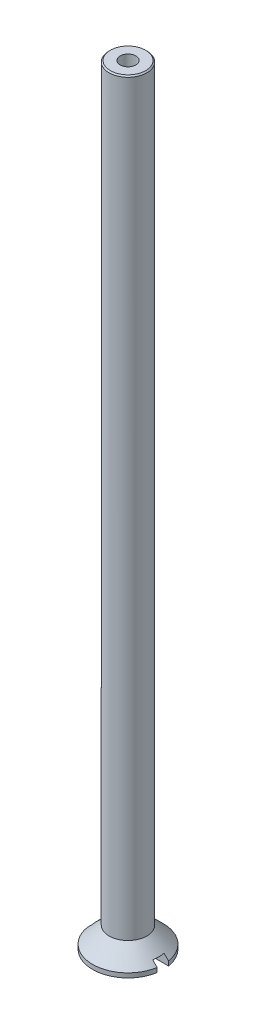
ISO-10303-21;
HEADER;
FILE_DESCRIPTION(('STEP AP214'),'2;1');
FILE_NAME('part.step','',(''),(''),'','','');
FILE_SCHEMA(('AUTOMOTIVE_DESIGN { 1 0 10303 214 1 1 1 1 }'));
ENDSEC;
DATA;
#1=APPLICATION_CONTEXT('core data for automotive mechanical design processes');
#2=APPLICATION_PROTOCOL_DEFINITION('international standard','automotive_design',2000,#1);
#3=PRODUCT_CONTEXT('',#1,'mechanical');
#4=PRODUCT('Part','Part','',(#3));
#5=PRODUCT_RELATED_PRODUCT_CATEGORY('part','',(#4));
#6=PRODUCT_DEFINITION_FORMATION('','',#4);
#7=PRODUCT_DEFINITION_CONTEXT('part definition',#1,'design');
#8=PRODUCT_DEFINITION('design','',#6,#7);
#9=PRODUCT_DEFINITION_SHAPE('','',#8);
#10=(LENGTH_UNIT() NAMED_UNIT(*) SI_UNIT(.MILLI.,.METRE.));
#11=(NAMED_UNIT(*) PLANE_ANGLE_UNIT() SI_UNIT($,.RADIAN.));
#12=(NAMED_UNIT(*) SI_UNIT($,.STERADIAN.) SOLID_ANGLE_UNIT());
#13=UNCERTAINTY_MEASURE_WITH_UNIT(LENGTH_MEASURE(1.E-05),#10,'distance_accuracy_value','');
#14=(GEOMETRIC_REPRESENTATION_CONTEXT(3) GLOBAL_UNCERTAINTY_ASSIGNED_CONTEXT((#13)) GLOBAL_UNIT_ASSIGNED_CONTEXT((#10,
#11,#12)) REPRESENTATION_CONTEXT('',''));
#15=CARTESIAN_POINT('',(0.,0.,0.));
#16=DIRECTION('',(0.,0.,1.));
#17=DIRECTION('',(1.,0.,0.));
#18=AXIS2_PLACEMENT_3D('',#15,#16,#17);
#19=CARTESIAN_POINT('',(0.,0.,0.));
#20=DIRECTION('',(0.,-1.,0.));
#21=DIRECTION('',(0.,0.,-1.));
#22=AXIS2_PLACEMENT_3D('',#19,#20,#21);
#23=CYLINDRICAL_SURFACE('',#22,2.8);
#24=CARTESIAN_POINT('',(0.,0.35,0.));
#25=DIRECTION('',(0.,-1.,0.));
#26=DIRECTION('',(0.,0.,-1.));
#27=AXIS2_PLACEMENT_3D('',#24,#25,#26);
#28=CIRCLE('',#27,2.8);
#29=CARTESIAN_POINT('',(-2.7636027210871,0.35,-0.45));
#30=VERTEX_POINT('',#29);
#31=CARTESIAN_POINT('',(2.7636027210871,0.35,-0.45));
#32=VERTEX_POINT('',#31);
#33=EDGE_CURVE('E182',#30,#32,#28,.T.);
#34=ORIENTED_EDGE('',*,*,#33,.T.);
#35=DIRECTION('',(0.,-1.,0.));
#36=VECTOR('',#35,1.);
#37=CARTESIAN_POINT('',(2.7636027210871,0.,-0.45));
#38=LINE('',#37,#36);
#39=CARTESIAN_POINT('',(2.7636027210871,0.,-0.45));
#40=VERTEX_POINT('',#39);
#41=EDGE_CURVE('E142',#32,#40,#38,.T.);
#42=ORIENTED_EDGE('',*,*,#41,.T.);
#43=CARTESIAN_POINT('',(0.,0.,0.));
#44=DIRECTION('',(0.,-1.,0.));
#45=DIRECTION('',(0.,0.,-1.));
#46=AXIS2_PLACEMENT_3D('',#43,#44,#45);
#47=CIRCLE('',#46,2.8);
#48=CARTESIAN_POINT('',(-2.7636027210871,0.,-0.45));
#49=VERTEX_POINT('',#48);
#50=EDGE_CURVE('E178',#49,#40,#47,.T.);
#51=ORIENTED_EDGE('',*,*,#50,.F.);
#52=DIRECTION('',(0.,-1.,0.));
#53=VECTOR('',#52,1.);
#54=CARTESIAN_POINT('',(-2.7636027210871,0.,-0.45));
#55=LINE('',#54,#53);
#56=EDGE_CURVE('E72',#49,#30,#55,.F.);
#57=ORIENTED_EDGE('',*,*,#56,.T.);
#58=EDGE_LOOP('',(#34,#42,#51,#57));
#59=FACE_BOUND('',#58,.T.);
#60=ADVANCED_FACE('F56',(#59),#23,.T.);
#61=CARTESIAN_POINT('',(0.,0.,0.));
#62=DIRECTION('',(0.,1.,0.));
#63=DIRECTION('',(0.,0.,1.));
#64=AXIS2_PLACEMENT_3D('',#61,#62,#63);
#65=PLANE('',#64);
#66=CARTESIAN_POINT('',(2.7636027210871,0.,0.45));
#67=VERTEX_POINT('',#66);
#68=CARTESIAN_POINT('',(-2.7636027210871,0.,0.45));
#69=VERTEX_POINT('',#68);
#70=EDGE_CURVE('E181',#67,#69,#47,.T.);
#71=ORIENTED_EDGE('',*,*,#70,.T.);
#72=DIRECTION('',(1.,0.,0.));
#73=VECTOR('',#72,1.);
#74=CARTESIAN_POINT('',(0.,0.,0.45));
#75=LINE('',#74,#73);
#76=EDGE_CURVE('E191',#69,#67,#75,.T.);
#77=ORIENTED_EDGE('',*,*,#76,.T.);
#78=EDGE_LOOP('',(#71,#77));
#79=FACE_BOUND('',#78,.T.);
#80=ADVANCED_FACE('F218',(#79),#65,.F.);
#81=CARTESIAN_POINT('',(0.,61.,0.));
#82=DIRECTION('',(0.,-1.,0.));
#83=DIRECTION('',(0.,0.,-1.));
#84=AXIS2_PLACEMENT_3D('',#81,#82,#83);
#85=CYLINDRICAL_SURFACE('',#84,1.5);
#86=CARTESIAN_POINT('',(0.,60.9,0.));
#87=DIRECTION('',(0.,1.,0.));
#88=DIRECTION('',(0.,0.,1.));
#89=AXIS2_PLACEMENT_3D('',#86,#87,#88);
#90=CIRCLE('',#89,1.5);
#91=CARTESIAN_POINT('',(0.,60.9,1.5));
#92=VERTEX_POINT('',#91);
#93=EDGE_CURVE('E14',#92,#92,#90,.F.);
#94=ORIENTED_EDGE('',*,*,#93,.T.);
#95=EDGE_LOOP('',(#94));
#96=FACE_BOUND('',#95,.T.);
#97=CARTESIAN_POINT('',(0.,1.65,0.));
#98=DIRECTION('',(0.,-1.,0.));
#99=DIRECTION('',(0.,0.,-1.));
#100=AXIS2_PLACEMENT_3D('',#97,#98,#99);
#101=CIRCLE('',#100,1.5);
#102=CARTESIAN_POINT('',(0.,1.65,-1.5));
#103=VERTEX_POINT('',#102);
#104=EDGE_CURVE('E186',#103,#103,#101,.T.);
#105=ORIENTED_EDGE('',*,*,#104,.F.);
#106=EDGE_LOOP('',(#105));
#107=FACE_BOUND('',#106,.T.);
#108=ADVANCED_FACE('F225',(#96,#107),#85,.T.);
#109=CARTESIAN_POINT('',(0.,61.,0.));
#110=DIRECTION('',(0.,1.,0.));
#111=DIRECTION('',(0.,0.,1.));
#112=AXIS2_PLACEMENT_3D('',#109,#110,#111);
#113=PLANE('',#112);
#114=CARTESIAN_POINT('',(0.,61.,0.));
#115=DIRECTION('',(0.,1.,0.));
#116=DIRECTION('',(0.,0.,1.));
#117=AXIS2_PLACEMENT_3D('',#114,#115,#116);
#118=CIRCLE('',#117,0.624999999999999);
#119=CARTESIAN_POINT('',(0.,61.,0.624999999999999));
#120=VERTEX_POINT('',#119);
#121=EDGE_CURVE('E123',#120,#120,#118,.T.);
#122=ORIENTED_EDGE('',*,*,#121,.F.);
#123=EDGE_LOOP('',(#122));
#124=FACE_BOUND('',#123,.T.);
#125=CARTESIAN_POINT('',(0.,61.,0.));
#126=DIRECTION('',(0.,1.,0.));
#127=DIRECTION('',(0.,0.,1.));
#128=AXIS2_PLACEMENT_3D('',#125,#126,#127);
#129=CIRCLE('',#128,1.40000000000003);
#130=CARTESIAN_POINT('',(0.,61.,1.40000000000003));
#131=VERTEX_POINT('',#130);
#132=EDGE_CURVE('E65',#131,#131,#129,.T.);
#133=ORIENTED_EDGE('',*,*,#132,.T.);
#134=EDGE_LOOP('',(#133));
#135=FACE_BOUND('',#134,.T.);
#136=ADVANCED_FACE('F241',(#124,#135),#113,.T.);
#137=CARTESIAN_POINT('',(0.,3.14999999999999,0.));
#138=DIRECTION('',(0.,-1.,0.));
#139=DIRECTION('',(0.,0.,-1.));
#140=AXIS2_PLACEMENT_3D('',#137,#138,#139);
#141=CONICAL_SURFACE('',#140,0.,0.78539816339745);
#142=CARTESIAN_POINT('',(0.,0.7,0.));
#143=DIRECTION('',(0.,1.,0.));
#144=DIRECTION('',(0.,0.,1.));
#145=AXIS2_PLACEMENT_3D('',#142,#143,#144);
#146=CIRCLE('',#145,2.45);
#147=CARTESIAN_POINT('',(-2.40831891575846,0.7,-0.45));
#148=VERTEX_POINT('',#147);
#149=CARTESIAN_POINT('',(-2.40831891575846,0.7,0.45));
#150=VERTEX_POINT('',#149);
#151=EDGE_CURVE('E196',#148,#150,#146,.T.);
#152=ORIENTED_EDGE('',*,*,#151,.T.);
#153=CARTESIAN_POINT('',(-0.298776212016066,2.60984518435573,0.450000000000001));
#154=CARTESIAN_POINT('',(-0.322207715432802,2.59685164982422,0.450000000000001));
#155=CARTESIAN_POINT('',(-0.345198404646912,2.58310982215854,0.450000000000001));
#156=CARTESIAN_POINT('',(-0.390437472167723,2.55449602682399,0.450000000000001));
#157=CARTESIAN_POINT('',(-0.412686561736399,2.53962518964734,0.450000000000001));
#158=CARTESIAN_POINT('',(-0.456574803618822,2.50912930894527,0.450000000000001));
#159=CARTESIAN_POINT('',(-0.478215289249731,2.49350615727111,0.450000000000001));
#160=CARTESIAN_POINT('',(-0.521063916228339,2.46166711436821,0.450000000000001));
#161=CARTESIAN_POINT('',(-0.542271933205446,2.44545105627245,0.450000000000001));
#162=CARTESIAN_POINT('',(-0.605266307946208,2.39623902312595,0.450000000000001));
#163=CARTESIAN_POINT('',(-0.646543249963482,2.36259302348412,0.450000000000001));
#164=CARTESIAN_POINT('',(-0.728242951121311,2.29422801128412,0.450000000000001));
#165=CARTESIAN_POINT('',(-0.768665016105559,2.25950817915744,0.450000000000001));
#166=CARTESIAN_POINT('',(-0.882774250759681,2.15981051493085,0.450000000000001));
#167=CARTESIAN_POINT('',(-0.955750376979239,2.09402119872132,0.450000000000001));
#168=CARTESIAN_POINT('',(-1.10063125362607,1.96127271631832,0.45));
#169=CARTESIAN_POINT('',(-1.17253589871441,1.8943134364916,0.45));
#170=CARTESIAN_POINT('',(-1.31567910927972,1.75970585188454,0.45));
#171=CARTESIAN_POINT('',(-1.3869177621037,1.69205763996212,0.45));
#172=CARTESIAN_POINT('',(-1.52896768813463,1.55632181380124,0.45));
#173=CARTESIAN_POINT('',(-1.59977898102684,1.4882342201054,0.45));
#174=CARTESIAN_POINT('',(-1.81233766800467,1.28300195981761,0.45));
#175=CARTESIAN_POINT('',(-1.9536562748254,1.1454135145676,0.45));
#176=CARTESIAN_POINT('',(-2.23570298672782,0.869644127065907,0.45));
#177=CARTESIAN_POINT('',(-2.37643111158253,0.731463204972458,0.45));
#178=CARTESIAN_POINT('',(-2.69537511432416,0.417500990282752,0.45));
#179=CARTESIAN_POINT('',(-2.87348438088669,0.241611402447328,0.45));
#180=CARTESIAN_POINT('',(-3.22938873734787,-0.110489768599331,0.45));
#181=CARTESIAN_POINT('',(-3.4071838229797,-0.286701356118458,0.45));
#182=CARTESIAN_POINT('',(-3.76160041309739,-0.63835694536333,0.45));
#183=CARTESIAN_POINT('',(-3.93822300354347,-0.813799852741172,0.45));
#184=CARTESIAN_POINT('',(-4.29132960516176,-1.16481936409463,0.45));
#185=CARTESIAN_POINT('',(-4.46781361853333,-1.34039596585757,0.449999999999999));
#186=CARTESIAN_POINT('',(-4.64426004504833,-1.51601021923787,0.449999999999999));
#187=B_SPLINE_CURVE_WITH_KNOTS('',3,(#153,#154,#155,#156,#157,#158,#159,#160,#161,#162,#163,
#164,#165,#166,#167,#168,#169,#170,#171,#172,#173,#174,#175,#176,#177,#178,#179,#180,#181,#182,
#183,#184,#185,#186),.UNSPECIFIED.,.F.,.F.,(4,2,2,2,2,2,2,2,2,2,2,2,2,2,2,2,4),(0.,
0.0803327599675579,0.160586116467572,0.240647244053775,0.320731080078705,0.480455345202402,
0.640304678715239,0.935033469242759,1.22979104634106,1.52450940685566,1.81921408667817,
2.41091365678155,3.0025932523723,3.75355204641094,4.50452096184673,5.25136875766856,
5.99820445052117),.UNSPECIFIED.);
#188=CARTESIAN_POINT('',(-2.7636027210871,0.35,0.45));
#189=VERTEX_POINT('',#188);
#190=EDGE_CURVE('E173',#150,#189,#187,.T.);
#191=ORIENTED_EDGE('',*,*,#190,.T.);
#192=CARTESIAN_POINT('',(2.7636027210871,0.35,0.45));
#193=VERTEX_POINT('',#192);
#194=EDGE_CURVE('E185',#193,#189,#28,.T.);
#195=ORIENTED_EDGE('',*,*,#194,.F.);
#196=CARTESIAN_POINT('',(4.64426004504833,-1.51601021923787,0.449999999999999));
#197=CARTESIAN_POINT('',(4.46726844214302,-1.33985253590359,0.449999999999999));
#198=CARTESIAN_POINT('',(4.29023841473186,-1.16373339081551,0.45));
#199=CARTESIAN_POINT('',(3.93607209226861,-0.81166294672658,0.45));
#200=CARTESIAN_POINT('',(3.75893582073525,-0.63571162406431,0.45));
#201=CARTESIAN_POINT('',(3.4045503847787,-0.284089939579888,0.45));
#202=CARTESIAN_POINT('',(3.22730131308808,-0.108419484349923,0.45));
#203=CARTESIAN_POINT('',(2.96117319150587,0.154857004621864,0.45));
#204=CARTESIAN_POINT('',(2.87241437359629,0.242584559715621,0.45));
#205=CARTESIAN_POINT('',(2.69478897016739,0.417933808898226,0.45));
#206=CARTESIAN_POINT('',(2.60592238268997,0.505555501004055,0.45));
#207=CARTESIAN_POINT('',(2.42796011453402,0.680740069215278,0.45));
#208=CARTESIAN_POINT('',(2.33886429483665,0.768302804134789,0.45));
#209=CARTESIAN_POINT('',(2.16048126157654,0.943221366641974,0.45));
#210=CARTESIAN_POINT('',(2.071194061131,1.03057720759745,0.45));
#211=CARTESIAN_POINT('',(1.89238051856517,1.20495192290571,0.45));
#212=CARTESIAN_POINT('',(1.80285432275034,1.29197094722884,0.45));
#213=CARTESIAN_POINT('',(1.62335209462943,1.46558774850875,0.45));
#214=CARTESIAN_POINT('',(1.53337596032914,1.55218542027472,0.45));
#215=CARTESIAN_POINT('',(1.39780334902743,1.68160763545672,0.45));
#216=CARTESIAN_POINT('',(1.35247012016709,1.72470779032322,0.45));
#217=CARTESIAN_POINT('',(1.2615711374709,1.81065630297793,0.45));
#218=CARTESIAN_POINT('',(1.21600539964449,1.85350467767681,0.45));
#219=CARTESIAN_POINT('',(1.12459188860392,1.93882794684296,0.45));
#220=CARTESIAN_POINT('',(1.07874436401074,1.98130310734655,0.450000000000001));
#221=CARTESIAN_POINT('',(0.986594657883267,2.06578205364653,0.450000000000001));
#222=CARTESIAN_POINT('',(0.940292366413195,2.10778571992883,0.450000000000001));
#223=CARTESIAN_POINT('',(0.846912999808935,2.19118878934576,0.450000000000001));
#224=CARTESIAN_POINT('',(0.799834123954589,2.23258618044481,0.450000000000001));
#225=CARTESIAN_POINT('',(0.704723510999766,2.31421853959602,0.450000000000001));
#226=CARTESIAN_POINT('',(0.656692454689912,2.35445429099034,0.450000000000001));
#227=CARTESIAN_POINT('',(0.583364417212797,2.4133825710132,0.450000000000001));
#228=CARTESIAN_POINT('',(0.558667066365557,2.43281812750596,0.450000000000001));
#229=CARTESIAN_POINT('',(0.508745655592188,2.47098349277823,0.450000000000001));
#230=CARTESIAN_POINT('',(0.483521788622204,2.48971355328606,0.450000000000001));
#231=CARTESIAN_POINT('',(0.432308841517155,2.52625151275107,0.450000000000001));
#232=CARTESIAN_POINT('',(0.406318036007726,2.54405703681088,0.450000000000001));
#233=CARTESIAN_POINT('',(0.353346175446179,2.57819521484321,0.450000000000001));
#234=CARTESIAN_POINT('',(0.326363906941663,2.59452597323762,0.450000000000001));
#235=CARTESIAN_POINT('',(0.298776212016066,2.60984518435573,0.450000000000001));
#236=B_SPLINE_CURVE_WITH_KNOTS('',3,(#196,#197,#198,#199,#200,#201,#202,#203,#204,#205,#206,
#207,#208,#209,#210,#211,#212,#213,#214,#215,#216,#217,#218,#219,#220,#221,#222,#223,#224,#225,
#226,#227,#228,#229,#230,#231,#232,#233,#234,#235),.UNSPECIFIED.,.F.,.F.,(4,2,2,2,2,2,2,2,2,2,2,
2,2,2,2,2,2,2,2,4),(0.,0.749144913994078,1.49816095965858,2.24682351255026,2.62121397296048,
2.99561134094179,3.37037463381237,3.74511301320602,4.11965900661443,4.49429414587232,
4.68194882805443,4.86959075905593,5.05708584532342,5.24462743065997,5.43269207378657,
5.62062678563336,5.71490039829411,5.80914004819768,5.9036108802663,5.99820146094093),.UNSPECIFIED.);
#237=CARTESIAN_POINT('',(2.40831891575846,0.7,0.45));
#238=VERTEX_POINT('',#237);
#239=EDGE_CURVE('E166',#193,#238,#236,.T.);
#240=ORIENTED_EDGE('',*,*,#239,.T.);
#241=CARTESIAN_POINT('',(2.40831891575846,0.7,-0.45));
#242=VERTEX_POINT('',#241);
#243=EDGE_CURVE('E194',#238,#242,#146,.T.);
#244=ORIENTED_EDGE('',*,*,#243,.T.);
#245=CARTESIAN_POINT('',(0.298776212016066,2.60984518435573,-0.45));
#246=CARTESIAN_POINT('',(0.322207715432802,2.59685164982422,-0.45));
#247=CARTESIAN_POINT('',(0.345198404646912,2.58310982215854,-0.45));
#248=CARTESIAN_POINT('',(0.390437472167723,2.55449602682399,-0.45));
#249=CARTESIAN_POINT('',(0.412686561736399,2.53962518964734,-0.45));
#250=CARTESIAN_POINT('',(0.456574803618822,2.50912930894527,-0.45));
#251=CARTESIAN_POINT('',(0.478215289249731,2.49350615727111,-0.45));
#252=CARTESIAN_POINT('',(0.521063916228339,2.46166711436821,-0.45));
#253=CARTESIAN_POINT('',(0.542271933205446,2.44545105627245,-0.45));
#254=CARTESIAN_POINT('',(0.605266307946208,2.39623902312595,-0.45));
#255=CARTESIAN_POINT('',(0.646543249963482,2.36259302348412,-0.45));
#256=CARTESIAN_POINT('',(0.728242951121311,2.29422801128412,-0.45));
#257=CARTESIAN_POINT('',(0.768665016105559,2.25950817915744,-0.45));
#258=CARTESIAN_POINT('',(0.882774250759681,2.15981051493085,-0.45));
#259=CARTESIAN_POINT('',(0.955750376979239,2.09402119872132,-0.45));
#260=CARTESIAN_POINT('',(1.10063125362607,1.96127271631832,-0.45));
#261=CARTESIAN_POINT('',(1.17253589871441,1.8943134364916,-0.45));
#262=CARTESIAN_POINT('',(1.31567910927972,1.75970585188454,-0.45));
#263=CARTESIAN_POINT('',(1.3869177621037,1.69205763996212,-0.45));
#264=CARTESIAN_POINT('',(1.52896768813463,1.55632181380124,-0.45));
#265=CARTESIAN_POINT('',(1.59977898102683,1.4882342201054,-0.45));
#266=CARTESIAN_POINT('',(1.81233766800466,1.28300195981761,-0.45));
#267=CARTESIAN_POINT('',(1.9536562748254,1.1454135145676,-0.45));
#268=CARTESIAN_POINT('',(2.23570298672782,0.869644127065907,-0.45));
#269=CARTESIAN_POINT('',(2.37643111158253,0.731463204972458,-0.45));
#270=CARTESIAN_POINT('',(2.69537511432416,0.417500990282752,-0.45));
#271=CARTESIAN_POINT('',(2.87348438088669,0.241611402447329,-0.45));
#272=CARTESIAN_POINT('',(3.22938873734787,-0.11048976859933,-0.45));
#273=CARTESIAN_POINT('',(3.4071838229797,-0.286701356118458,-0.45));
#274=CARTESIAN_POINT('',(3.76160041309739,-0.63835694536333,-0.45));
#275=CARTESIAN_POINT('',(3.93822300354347,-0.813799852741172,-0.45));
#276=CARTESIAN_POINT('',(4.29132960516176,-1.16481936409463,-0.45));
#277=CARTESIAN_POINT('',(4.46781361853333,-1.34039596585757,-0.45));
#278=CARTESIAN_POINT('',(4.64426004504833,-1.51601021923787,-0.45));
#279=B_SPLINE_CURVE_WITH_KNOTS('',3,(#245,#246,#247,#248,#249,#250,#251,#252,#253,#254,#255,
#256,#257,#258,#259,#260,#261,#262,#263,#264,#265,#266,#267,#268,#269,#270,#271,#272,#273,#274,
#275,#276,#277,#278),.UNSPECIFIED.,.F.,.F.,(4,2,2,2,2,2,2,2,2,2,2,2,2,2,2,2,4),(0.,
0.0803327599675579,0.160586116467573,0.240647244053774,0.320731080078705,0.480455345202402,
0.640304678715238,0.935033469242758,1.22979104634106,1.52450940685566,1.81921408667817,
2.41091365678155,3.0025932523723,3.75355204641094,4.50452096184673,5.25136875766856,
5.99820445052117),.UNSPECIFIED.);
#280=EDGE_CURVE('E157',#242,#32,#279,.T.);
#281=ORIENTED_EDGE('',*,*,#280,.T.);
#282=ORIENTED_EDGE('',*,*,#33,.F.);
#283=CARTESIAN_POINT('',(-4.64426004504833,-1.51601021923787,-0.45));
#284=CARTESIAN_POINT('',(-4.46726844214302,-1.33985253590359,-0.45));
#285=CARTESIAN_POINT('',(-4.29023841473186,-1.16373339081551,-0.45));
#286=CARTESIAN_POINT('',(-3.93607209226861,-0.81166294672658,-0.45));
#287=CARTESIAN_POINT('',(-3.75893582073525,-0.63571162406431,-0.45));
#288=CARTESIAN_POINT('',(-3.4045503847787,-0.284089939579888,-0.45));
#289=CARTESIAN_POINT('',(-3.22730131308808,-0.108419484349923,-0.45));
#290=CARTESIAN_POINT('',(-2.96117319150587,0.154857004621864,-0.45));
#291=CARTESIAN_POINT('',(-2.87241437359629,0.242584559715621,-0.45));
#292=CARTESIAN_POINT('',(-2.69478897016739,0.417933808898225,-0.45));
#293=CARTESIAN_POINT('',(-2.60592238268997,0.505555501004055,-0.45));
#294=CARTESIAN_POINT('',(-2.42796011453402,0.680740069215278,-0.45));
#295=CARTESIAN_POINT('',(-2.33886429483665,0.768302804134789,-0.45));
#296=CARTESIAN_POINT('',(-2.16048126157654,0.943221366641974,-0.45));
#297=CARTESIAN_POINT('',(-2.071194061131,1.03057720759745,-0.45));
#298=CARTESIAN_POINT('',(-1.89238051856517,1.20495192290571,-0.45));
#299=CARTESIAN_POINT('',(-1.80285432275034,1.29197094722884,-0.45));
#300=CARTESIAN_POINT('',(-1.62335209462943,1.46558774850875,-0.45));
#301=CARTESIAN_POINT('',(-1.53337596032914,1.55218542027472,-0.45));
#302=CARTESIAN_POINT('',(-1.39780334902743,1.68160763545672,-0.45));
#303=CARTESIAN_POINT('',(-1.35247012016709,1.72470779032322,-0.45));
#304=CARTESIAN_POINT('',(-1.2615711374709,1.81065630297793,-0.45));
#305=CARTESIAN_POINT('',(-1.21600539964449,1.85350467767681,-0.45));
#306=CARTESIAN_POINT('',(-1.12459188860392,1.93882794684296,-0.45));
#307=CARTESIAN_POINT('',(-1.07874436401074,1.98130310734655,-0.45));
#308=CARTESIAN_POINT('',(-0.986594657883268,2.06578205364653,-0.45));
#309=CARTESIAN_POINT('',(-0.940292366413195,2.10778571992883,-0.45));
#310=CARTESIAN_POINT('',(-0.846912999808935,2.19118878934576,-0.45));
#311=CARTESIAN_POINT('',(-0.799834123954589,2.23258618044481,-0.45));
#312=CARTESIAN_POINT('',(-0.704723510999767,2.31421853959602,-0.45));
#313=CARTESIAN_POINT('',(-0.656692454689912,2.35445429099034,-0.45));
#314=CARTESIAN_POINT('',(-0.583364417212798,2.4133825710132,-0.45));
#315=CARTESIAN_POINT('',(-0.558667066365558,2.43281812750596,-0.45));
#316=CARTESIAN_POINT('',(-0.508745655592189,2.47098349277823,-0.45));
#317=CARTESIAN_POINT('',(-0.483521788622204,2.48971355328606,-0.45));
#318=CARTESIAN_POINT('',(-0.432308841517155,2.52625151275107,-0.45));
#319=CARTESIAN_POINT('',(-0.406318036007727,2.54405703681088,-0.45));
#320=CARTESIAN_POINT('',(-0.35334617544618,2.57819521484321,-0.45));
#321=CARTESIAN_POINT('',(-0.326363906941664,2.59452597323762,-0.45));
#322=CARTESIAN_POINT('',(-0.298776212016066,2.60984518435573,-0.45));
#323=B_SPLINE_CURVE_WITH_KNOTS('',3,(#283,#284,#285,#286,#287,#288,#289,#290,#291,#292,#293,
#294,#295,#296,#297,#298,#299,#300,#301,#302,#303,#304,#305,#306,#307,#308,#309,#310,#311,#312,
#313,#314,#315,#316,#317,#318,#319,#320,#321,#322),.UNSPECIFIED.,.F.,.F.,(4,2,2,2,2,2,2,2,2,2,2,
2,2,2,2,2,2,2,2,4),(0.,0.749144913994078,1.49816095965858,2.24682351255026,2.62121397296048,
2.99561134094179,3.37037463381237,3.74511301320602,4.11965900661443,4.49429414587232,
4.68194882805443,4.86959075905593,5.05708584532342,5.24462743065997,5.43269207378657,
5.62062678563335,5.71490039829411,5.80914004819768,5.9036108802663,5.99820146094093),.UNSPECIFIED.);
#324=EDGE_CURVE('E134',#30,#148,#323,.T.);
#325=ORIENTED_EDGE('',*,*,#324,.T.);
#326=EDGE_LOOP('',(#152,#191,#195,#240,#244,#281,#282,#325));
#327=FACE_BOUND('',#326,.T.);
#328=ORIENTED_EDGE('',*,*,#104,.T.);
#329=EDGE_LOOP('',(#328));
#330=FACE_BOUND('',#329,.T.);
#331=ADVANCED_FACE('F144',(#327,#330),#141,.T.);
#332=ORIENTED_EDGE('',*,*,#194,.T.);
#333=DIRECTION('',(0.,-1.,0.));
#334=VECTOR('',#333,1.);
#335=CARTESIAN_POINT('',(-2.7636027210871,0.,0.45));
#336=LINE('',#335,#334);
#337=EDGE_CURVE('E80',#189,#69,#336,.T.);
#338=ORIENTED_EDGE('',*,*,#337,.T.);
#339=ORIENTED_EDGE('',*,*,#70,.F.);
#340=DIRECTION('',(0.,-1.,0.));
#341=VECTOR('',#340,1.);
#342=CARTESIAN_POINT('',(2.7636027210871,0.,0.45));
#343=LINE('',#342,#341);
#344=EDGE_CURVE('E163',#67,#193,#343,.F.);
#345=ORIENTED_EDGE('',*,*,#344,.T.);
#346=EDGE_LOOP('',(#332,#338,#339,#345));
#347=FACE_BOUND('',#346,.T.);
#348=ADVANCED_FACE('F216',(#347),#23,.T.);
#349=ORIENTED_EDGE('',*,*,#50,.T.);
#350=DIRECTION('',(-1.,0.,0.));
#351=VECTOR('',#350,1.);
#352=CARTESIAN_POINT('',(0.,0.,-0.45));
#353=LINE('',#352,#351);
#354=EDGE_CURVE('E189',#40,#49,#353,.T.);
#355=ORIENTED_EDGE('',*,*,#354,.T.);
#356=EDGE_LOOP('',(#349,#355));
#357=FACE_BOUND('',#356,.T.);
#358=ADVANCED_FACE('F214',(#357),#65,.F.);
#359=CARTESIAN_POINT('',(-2.8,0.7,0.45));
#360=DIRECTION('',(0.,1.,0.));
#361=DIRECTION('',(0.,0.,1.));
#362=AXIS2_PLACEMENT_3D('',#359,#360,#361);
#363=PLANE('',#362);
#364=DIRECTION('',(1.,0.,0.));
#365=VECTOR('',#364,1.);
#366=CARTESIAN_POINT('',(-2.8,0.7,0.45));
#367=LINE('',#366,#365);
#368=EDGE_CURVE('E126',#150,#238,#367,.T.);
#369=ORIENTED_EDGE('',*,*,#368,.F.);
#370=ORIENTED_EDGE('',*,*,#151,.F.);
#371=DIRECTION('',(1.,0.,0.));
#372=VECTOR('',#371,1.);
#373=CARTESIAN_POINT('',(-2.8,0.7,-0.45));
#374=LINE('',#373,#372);
#375=EDGE_CURVE('E122',#148,#242,#374,.T.);
#376=ORIENTED_EDGE('',*,*,#375,.T.);
#377=ORIENTED_EDGE('',*,*,#243,.F.);
#378=EDGE_LOOP('',(#369,#370,#376,#377));
#379=FACE_BOUND('',#378,.T.);
#380=ADVANCED_FACE('F154',(#379),#363,.F.);
#381=CARTESIAN_POINT('',(-2.8,0.,0.45));
#382=DIRECTION('',(0.,0.,1.));
#383=DIRECTION('',(0.,-1.,0.));
#384=AXIS2_PLACEMENT_3D('',#381,#382,#383);
#385=PLANE('',#384);
#386=ORIENTED_EDGE('',*,*,#368,.T.);
#387=ORIENTED_EDGE('',*,*,#239,.F.);
#388=ORIENTED_EDGE('',*,*,#344,.F.);
#389=ORIENTED_EDGE('',*,*,#76,.F.);
#390=ORIENTED_EDGE('',*,*,#337,.F.);
#391=ORIENTED_EDGE('',*,*,#190,.F.);
#392=EDGE_LOOP('',(#386,#387,#388,#389,#390,#391));
#393=FACE_BOUND('',#392,.T.);
#394=ADVANCED_FACE('F153',(#393),#385,.F.);
#395=CARTESIAN_POINT('',(-2.8,0.,-0.45));
#396=DIRECTION('',(0.,0.,-1.));
#397=DIRECTION('',(-1.,0.,0.));
#398=AXIS2_PLACEMENT_3D('',#395,#396,#397);
#399=PLANE('',#398);
#400=ORIENTED_EDGE('',*,*,#375,.F.);
#401=ORIENTED_EDGE('',*,*,#324,.F.);
#402=ORIENTED_EDGE('',*,*,#56,.F.);
#403=ORIENTED_EDGE('',*,*,#354,.F.);
#404=ORIENTED_EDGE('',*,*,#41,.F.);
#405=ORIENTED_EDGE('',*,*,#280,.F.);
#406=EDGE_LOOP('',(#400,#401,#402,#403,#404,#405));
#407=FACE_BOUND('',#406,.T.);
#408=ADVANCED_FACE('F148',(#407),#399,.F.);
#409=CARTESIAN_POINT('',(0.,61.,0.));
#410=DIRECTION('',(0.,-1.,0.));
#411=DIRECTION('',(0.,0.,-1.));
#412=AXIS2_PLACEMENT_3D('',#409,#410,#411);
#413=CONICAL_SURFACE('',#412,1.40000000000003,0.785398163397479);
#414=ORIENTED_EDGE('',*,*,#93,.F.);
#415=EDGE_LOOP('',(#414));
#416=FACE_BOUND('',#415,.T.);
#417=ORIENTED_EDGE('',*,*,#132,.F.);
#418=EDGE_LOOP('',(#417));
#419=FACE_BOUND('',#418,.T.);
#420=ADVANCED_FACE('F58',(#416,#419),#413,.T.);
#421=CARTESIAN_POINT('',(0.,54.,0.));
#422=DIRECTION('',(0.,1.,0.));
#423=DIRECTION('',(0.,0.,1.));
#424=AXIS2_PLACEMENT_3D('',#421,#422,#423);
#425=CONICAL_SURFACE('',#424,0.624999999999998,1.02974425867665);
#426=CARTESIAN_POINT('',(0.,53.6244621131078,0.));
#427=VERTEX_POINT('',#426);
#428=VERTEX_LOOP('',#427);
#429=FACE_BOUND('',#428,.T.);
#430=CARTESIAN_POINT('',(0.,54.,0.));
#431=DIRECTION('',(0.,1.,0.));
#432=DIRECTION('',(0.,0.,1.));
#433=AXIS2_PLACEMENT_3D('',#430,#431,#432);
#434=CIRCLE('',#433,0.624999999999998);
#435=CARTESIAN_POINT('',(0.,54.,0.624999999999998));
#436=VERTEX_POINT('',#435);
#437=EDGE_CURVE('E119',#436,#436,#434,.T.);
#438=ORIENTED_EDGE('',*,*,#437,.T.);
#439=EDGE_LOOP('',(#438));
#440=FACE_BOUND('',#439,.T.);
#441=ADVANCED_FACE('F112',(#429,#440),#425,.F.);
#442=CARTESIAN_POINT('',(0.,61.,0.));
#443=DIRECTION('',(0.,1.,0.));
#444=DIRECTION('',(0.,0.,1.));
#445=AXIS2_PLACEMENT_3D('',#442,#443,#444);
#446=CYLINDRICAL_SURFACE('',#445,0.624999999999999);
#447=ORIENTED_EDGE('',*,*,#437,.F.);
#448=EDGE_LOOP('',(#447));
#449=FACE_BOUND('',#448,.T.);
#450=ORIENTED_EDGE('',*,*,#121,.T.);
#451=EDGE_LOOP('',(#450));
#452=FACE_BOUND('',#451,.T.);
#453=ADVANCED_FACE('F115',(#449,#452),#446,.F.);
#454=CLOSED_SHELL('',(#60,#80,#108,#136,#331,#348,#358,#380,#394,#408,#420,#441,#453));
#455=MANIFOLD_SOLID_BREP('B2',#454);
#456=ADVANCED_BREP_SHAPE_REPRESENTATION('',(#18,#455),#14);
#457=SHAPE_DEFINITION_REPRESENTATION(#9,#456);
ENDSEC;
END-ISO-10303-21;
